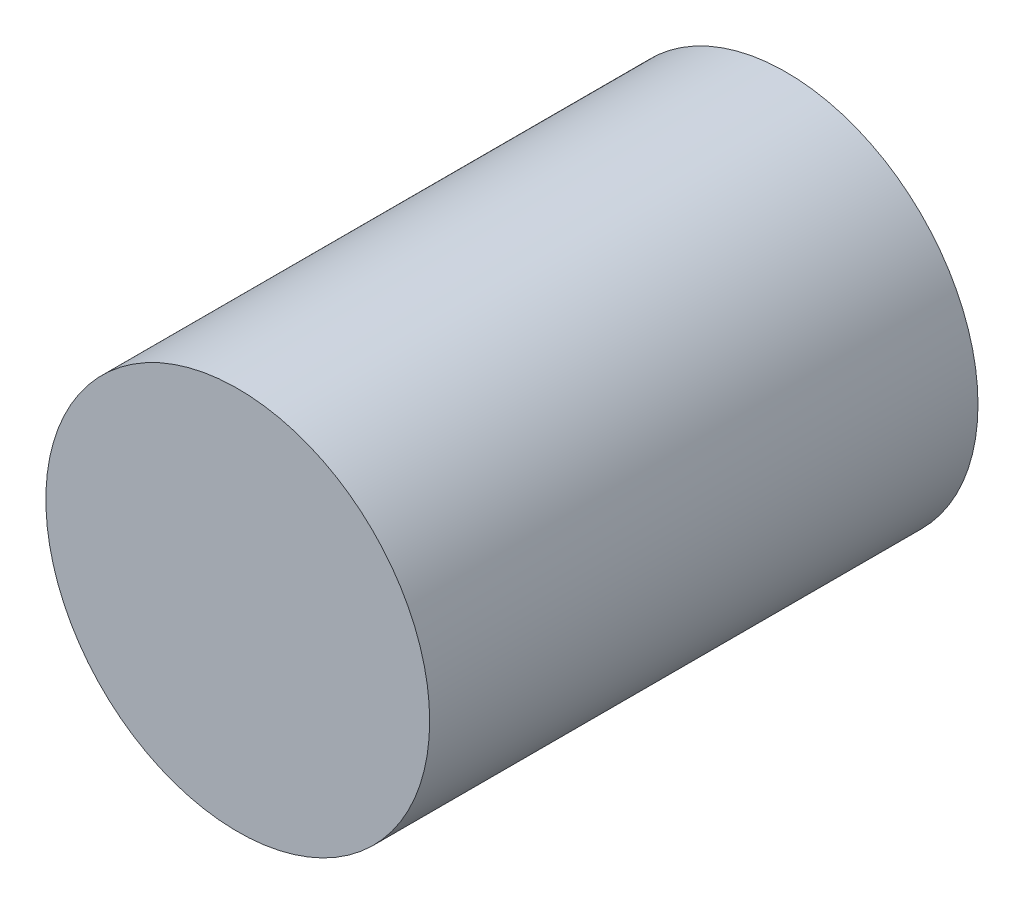
ISO-10303-21;
HEADER;
FILE_DESCRIPTION(('STEP AP214'),'2;1');
FILE_NAME('part.step','',(''),(''),'','','');
FILE_SCHEMA(('AUTOMOTIVE_DESIGN { 1 0 10303 214 1 1 1 1 }'));
ENDSEC;
DATA;
#1=APPLICATION_CONTEXT('core data for automotive mechanical design processes');
#2=APPLICATION_PROTOCOL_DEFINITION('international standard','automotive_design',2000,#1);
#3=PRODUCT_CONTEXT('',#1,'mechanical');
#4=PRODUCT('Part','Part','',(#3));
#5=PRODUCT_RELATED_PRODUCT_CATEGORY('part','',(#4));
#6=PRODUCT_DEFINITION_FORMATION('','',#4);
#7=PRODUCT_DEFINITION_CONTEXT('part definition',#1,'design');
#8=PRODUCT_DEFINITION('design','',#6,#7);
#9=PRODUCT_DEFINITION_SHAPE('','',#8);
#10=(LENGTH_UNIT() NAMED_UNIT(*) SI_UNIT(.MILLI.,.METRE.));
#11=(NAMED_UNIT(*) PLANE_ANGLE_UNIT() SI_UNIT($,.RADIAN.));
#12=(NAMED_UNIT(*) SI_UNIT($,.STERADIAN.) SOLID_ANGLE_UNIT());
#13=UNCERTAINTY_MEASURE_WITH_UNIT(LENGTH_MEASURE(1.E-05),#10,'distance_accuracy_value','');
#14=(GEOMETRIC_REPRESENTATION_CONTEXT(3) GLOBAL_UNCERTAINTY_ASSIGNED_CONTEXT((#13)) GLOBAL_UNIT_ASSIGNED_CONTEXT((#10,
#11,#12)) REPRESENTATION_CONTEXT('',''));
#15=CARTESIAN_POINT('',(0.,0.,0.));
#16=DIRECTION('',(0.,0.,1.));
#17=DIRECTION('',(1.,0.,0.));
#18=AXIS2_PLACEMENT_3D('',#15,#16,#17);
#19=CARTESIAN_POINT('',(0.,0.,12.7));
#20=DIRECTION('',(0.,0.,-1.));
#21=DIRECTION('',(-1.,0.,0.));
#22=AXIS2_PLACEMENT_3D('',#19,#20,#21);
#23=CYLINDRICAL_SURFACE('',#22,4.445);
#24=CARTESIAN_POINT('',(0.,0.,12.7));
#25=DIRECTION('',(0.,0.,1.));
#26=DIRECTION('',(1.,0.,0.));
#27=AXIS2_PLACEMENT_3D('',#24,#25,#26);
#28=CIRCLE('',#27,4.445);
#29=CARTESIAN_POINT('',(4.445,0.,12.7));
#30=VERTEX_POINT('',#29);
#31=EDGE_CURVE('E10',#30,#30,#28,.T.);
#32=ORIENTED_EDGE('',*,*,#31,.F.);
#33=EDGE_LOOP('',(#32));
#34=FACE_BOUND('',#33,.T.);
#35=CARTESIAN_POINT('',(0.,0.,0.));
#36=DIRECTION('',(0.,0.,1.));
#37=DIRECTION('',(1.,0.,0.));
#38=AXIS2_PLACEMENT_3D('',#35,#36,#37);
#39=CIRCLE('',#38,4.445);
#40=CARTESIAN_POINT('',(4.445,0.,0.));
#41=VERTEX_POINT('',#40);
#42=EDGE_CURVE('E37',#41,#41,#39,.T.);
#43=ORIENTED_EDGE('',*,*,#42,.T.);
#44=EDGE_LOOP('',(#43));
#45=FACE_BOUND('',#44,.T.);
#46=ADVANCED_FACE('F34',(#34,#45),#23,.T.);
#47=CARTESIAN_POINT('',(0.,0.,12.7));
#48=DIRECTION('',(0.,0.,1.));
#49=DIRECTION('',(1.,0.,0.));
#50=AXIS2_PLACEMENT_3D('',#47,#48,#49);
#51=PLANE('',#50);
#52=ORIENTED_EDGE('',*,*,#31,.T.);
#53=EDGE_LOOP('',(#52));
#54=FACE_BOUND('',#53,.T.);
#55=ADVANCED_FACE('F54',(#54),#51,.T.);
#56=CARTESIAN_POINT('',(0.,0.,0.));
#57=DIRECTION('',(0.,0.,1.));
#58=DIRECTION('',(1.,0.,0.));
#59=AXIS2_PLACEMENT_3D('',#56,#57,#58);
#60=PLANE('',#59);
#61=ORIENTED_EDGE('',*,*,#42,.F.);
#62=EDGE_LOOP('',(#61));
#63=FACE_BOUND('',#62,.T.);
#64=ADVANCED_FACE('F52',(#63),#60,.F.);
#65=CLOSED_SHELL('',(#46,#55,#64));
#66=MANIFOLD_SOLID_BREP('B2',#65);
#67=ADVANCED_BREP_SHAPE_REPRESENTATION('',(#18,#66),#14);
#68=SHAPE_DEFINITION_REPRESENTATION(#9,#67);
ENDSEC;
END-ISO-10303-21;
